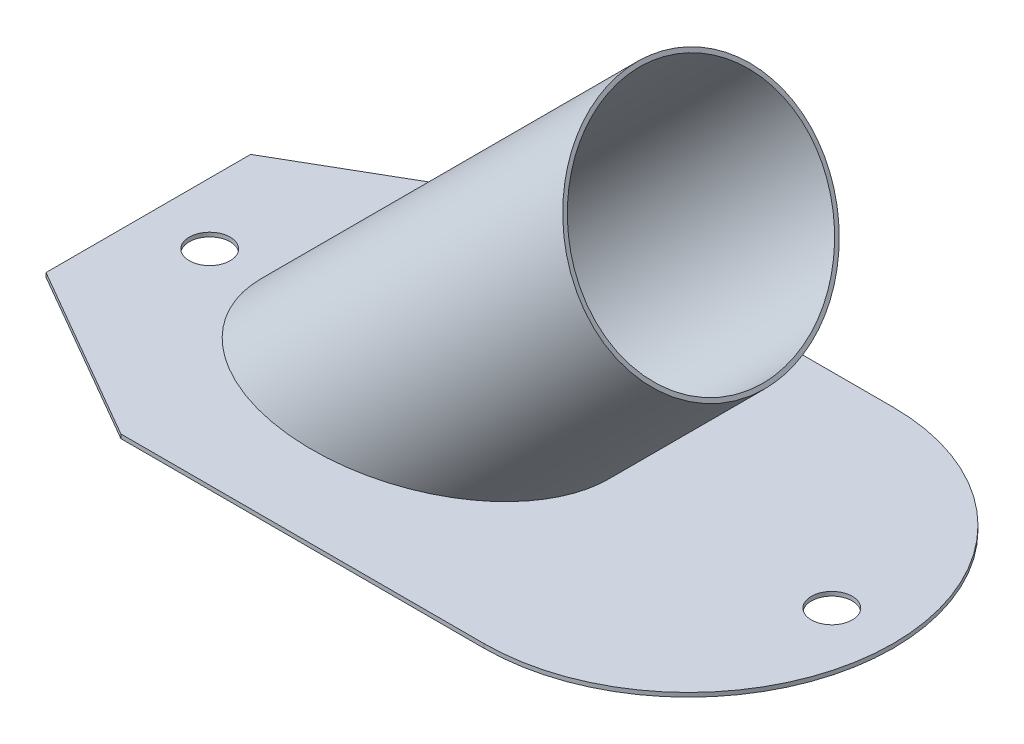
ISO-10303-21;
HEADER;
FILE_DESCRIPTION(('STEP AP214'),'2;1');
FILE_NAME('part.step','',(''),(''),'','','');
FILE_SCHEMA(('AUTOMOTIVE_DESIGN { 1 0 10303 214 1 1 1 1 }'));
ENDSEC;
DATA;
#1=APPLICATION_CONTEXT('core data for automotive mechanical design processes');
#2=APPLICATION_PROTOCOL_DEFINITION('international standard','automotive_design',2000,#1);
#3=PRODUCT_CONTEXT('',#1,'mechanical');
#4=PRODUCT('Part','Part','',(#3));
#5=PRODUCT_RELATED_PRODUCT_CATEGORY('part','',(#4));
#6=PRODUCT_DEFINITION_FORMATION('','',#4);
#7=PRODUCT_DEFINITION_CONTEXT('part definition',#1,'design');
#8=PRODUCT_DEFINITION('design','',#6,#7);
#9=PRODUCT_DEFINITION_SHAPE('','',#8);
#10=(LENGTH_UNIT() NAMED_UNIT(*) SI_UNIT(.MILLI.,.METRE.));
#11=(NAMED_UNIT(*) PLANE_ANGLE_UNIT() SI_UNIT($,.RADIAN.));
#12=(NAMED_UNIT(*) SI_UNIT($,.STERADIAN.) SOLID_ANGLE_UNIT());
#13=UNCERTAINTY_MEASURE_WITH_UNIT(LENGTH_MEASURE(1.E-05),#10,'distance_accuracy_value','');
#14=(GEOMETRIC_REPRESENTATION_CONTEXT(3) GLOBAL_UNCERTAINTY_ASSIGNED_CONTEXT((#13)) GLOBAL_UNIT_ASSIGNED_CONTEXT((#10,
#11,#12)) REPRESENTATION_CONTEXT('',''));
#15=CARTESIAN_POINT('',(0.,0.,0.));
#16=DIRECTION('',(0.,0.,1.));
#17=DIRECTION('',(1.,0.,0.));
#18=AXIS2_PLACEMENT_3D('',#15,#16,#17);
#19=CARTESIAN_POINT('',(21.2132034355964,-21.2132034355964,0.));
#20=DIRECTION('',(-0.707106781186548,-0.707106781186548,0.));
#21=DIRECTION('',(0.707106781186548,-0.707106781186548,0.));
#22=AXIS2_PLACEMENT_3D('',#19,#20,#21);
#23=CYLINDRICAL_SURFACE('',#22,30.);
#24=CARTESIAN_POINT('',(42.4264068711929,0.,0.));
#25=DIRECTION('',(0.,1.,0.));
#26=DIRECTION('',(-1.,0.,0.));
#27=AXIS2_PLACEMENT_3D('',#24,#25,#26);
#28=ELLIPSE('',#27,42.4264068711929,30.);
#29=CARTESIAN_POINT('',(0.,0.,0.));
#30=VERTEX_POINT('',#29);
#31=EDGE_CURVE('E37',#30,#30,#28,.T.);
#32=ORIENTED_EDGE('',*,*,#31,.T.);
#33=EDGE_LOOP('',(#32));
#34=FACE_BOUND('',#33,.T.);
#35=CARTESIAN_POINT('',(107.453024260403,65.0266173892097,0.));
#36=DIRECTION('',(-0.866025403784437,-0.500000000000003,0.));
#37=DIRECTION('',(0.500000000000003,-0.866025403784437,0.));
#38=AXIS2_PLACEMENT_3D('',#35,#36,#37);
#39=ELLIPSE('',#38,31.0582854123025,30.);
#40=CARTESIAN_POINT('',(122.982166966554,38.1293532241681,0.));
#41=VERTEX_POINT('',#40);
#42=EDGE_CURVE('E11',#41,#41,#39,.T.);
#43=ORIENTED_EDGE('',*,*,#42,.T.);
#44=EDGE_LOOP('',(#43));
#45=FACE_BOUND('',#44,.T.);
#46=ADVANCED_FACE('F30',(#34,#45),#23,.T.);
#47=CARTESIAN_POINT('',(91.9238815542512,91.9238815542512,-30.));
#48=DIRECTION('',(-0.866025403784437,-0.500000000000003,0.));
#49=DIRECTION('',(0.500000000000003,-0.866025403784437,0.));
#50=AXIS2_PLACEMENT_3D('',#47,#48,#49);
#51=PLANE('',#50);
#52=CARTESIAN_POINT('',(107.453024260403,65.0266173892097,0.));
#53=DIRECTION('',(-0.866025403784437,-0.500000000000003,0.));
#54=DIRECTION('',(0.500000000000003,-0.866025403784437,0.));
#55=AXIS2_PLACEMENT_3D('',#52,#53,#54);
#56=ELLIPSE('',#55,30.0230092318924,29.);
#57=CARTESIAN_POINT('',(122.464528876349,39.0259286963362,0.));
#58=VERTEX_POINT('',#57);
#59=EDGE_CURVE('E278',#58,#58,#56,.T.);
#60=ORIENTED_EDGE('',*,*,#59,.T.);
#61=EDGE_LOOP('',(#60));
#62=FACE_BOUND('',#61,.T.);
#63=ORIENTED_EDGE('',*,*,#42,.F.);
#64=EDGE_LOOP('',(#63));
#65=FACE_BOUND('',#64,.T.);
#66=ADVANCED_FACE('F144',(#62,#65),#51,.F.);
#67=CARTESIAN_POINT('',(104.426406871193,0.,0.));
#68=DIRECTION('',(0.,1.,0.));
#69=DIRECTION('',(0.,0.,1.));
#70=AXIS2_PLACEMENT_3D('',#67,#68,#69);
#71=PLANE('',#70);
#72=CARTESIAN_POINT('',(104.426406871193,0.,0.));
#73=DIRECTION('',(0.,1.,0.));
#74=DIRECTION('',(0.,0.,1.));
#75=AXIS2_PLACEMENT_3D('',#72,#73,#74);
#76=CIRCLE('',#75,50.);
#77=CARTESIAN_POINT('',(104.426406871193,0.,50.));
#78=VERTEX_POINT('',#77);
#79=CARTESIAN_POINT('',(104.426406871193,0.,-50.));
#80=VERTEX_POINT('',#79);
#81=EDGE_CURVE('E85',#78,#80,#76,.T.);
#82=ORIENTED_EDGE('',*,*,#81,.T.);
#83=DIRECTION('',(-1.,0.,0.));
#84=VECTOR('',#83,1.);
#85=CARTESIAN_POINT('',(104.426406871193,0.,-50.));
#86=LINE('',#85,#84);
#87=CARTESIAN_POINT('',(15.7276770604148,0.,-50.));
#88=VERTEX_POINT('',#87);
#89=EDGE_CURVE('E95',#80,#88,#86,.T.);
#90=ORIENTED_EDGE('',*,*,#89,.T.);
#91=DIRECTION('',(-0.866025403784439,0.,0.5));
#92=VECTOR('',#91,1.);
#93=CARTESIAN_POINT('',(15.7276770604148,0.,-50.));
#94=LINE('',#93,#92);
#95=CARTESIAN_POINT('',(-27.5735931288072,0.,-25.));
#96=VERTEX_POINT('',#95);
#97=EDGE_CURVE('E100',#88,#96,#94,.T.);
#98=ORIENTED_EDGE('',*,*,#97,.T.);
#99=DIRECTION('',(0.,0.,1.));
#100=VECTOR('',#99,1.);
#101=CARTESIAN_POINT('',(-27.5735931288072,0.,-25.));
#102=LINE('',#101,#100);
#103=CARTESIAN_POINT('',(-27.5735931288072,0.,25.));
#104=VERTEX_POINT('',#103);
#105=EDGE_CURVE('E114',#96,#104,#102,.T.);
#106=ORIENTED_EDGE('',*,*,#105,.T.);
#107=DIRECTION('',(0.866025403784438,0.,0.5));
#108=VECTOR('',#107,1.);
#109=CARTESIAN_POINT('',(-27.5735931288072,0.,25.));
#110=LINE('',#109,#108);
#111=CARTESIAN_POINT('',(15.7276770604148,0.,50.));
#112=VERTEX_POINT('',#111);
#113=EDGE_CURVE('E117',#104,#112,#110,.T.);
#114=ORIENTED_EDGE('',*,*,#113,.T.);
#115=DIRECTION('',(1.,0.,0.));
#116=VECTOR('',#115,1.);
#117=CARTESIAN_POINT('',(104.426406871193,0.,50.));
#118=LINE('',#117,#116);
#119=EDGE_CURVE('E105',#112,#78,#118,.T.);
#120=ORIENTED_EDGE('',*,*,#119,.T.);
#121=EDGE_LOOP('',(#82,#90,#98,#106,#114,#120));
#122=FACE_BOUND('',#121,.T.);
#123=CARTESIAN_POINT('',(-12.5735931288072,0.,0.));
#124=DIRECTION('',(0.,1.,0.));
#125=DIRECTION('',(0.,0.,1.));
#126=AXIS2_PLACEMENT_3D('',#123,#124,#125);
#127=CIRCLE('',#126,5.);
#128=CARTESIAN_POINT('',(-12.5735931288072,0.,5.00000000000002));
#129=VERTEX_POINT('',#128);
#130=EDGE_CURVE('E109',#129,#129,#127,.T.);
#131=ORIENTED_EDGE('',*,*,#130,.F.);
#132=EDGE_LOOP('',(#131));
#133=FACE_BOUND('',#132,.T.);
#134=CARTESIAN_POINT('',(139.426406871193,0.,0.));
#135=DIRECTION('',(0.,1.,0.));
#136=DIRECTION('',(0.,0.,1.));
#137=AXIS2_PLACEMENT_3D('',#134,#135,#136);
#138=CIRCLE('',#137,4.99999999999999);
#139=CARTESIAN_POINT('',(139.426406871193,0.,4.99999999999999));
#140=VERTEX_POINT('',#139);
#141=EDGE_CURVE('E273',#140,#140,#138,.T.);
#142=ORIENTED_EDGE('',*,*,#141,.F.);
#143=EDGE_LOOP('',(#142));
#144=FACE_BOUND('',#143,.T.);
#145=ORIENTED_EDGE('',*,*,#31,.F.);
#146=EDGE_LOOP('',(#145));
#147=FACE_BOUND('',#146,.T.);
#148=ADVANCED_FACE('F102',(#122,#133,#144,#147),#71,.T.);
#149=CARTESIAN_POINT('',(104.426406871193,-1.,0.));
#150=DIRECTION('',(0.,1.,0.));
#151=DIRECTION('',(0.,0.,1.));
#152=AXIS2_PLACEMENT_3D('',#149,#150,#151);
#153=CYLINDRICAL_SURFACE('',#152,50.);
#154=ORIENTED_EDGE('',*,*,#81,.F.);
#155=DIRECTION('',(0.,1.,0.));
#156=VECTOR('',#155,1.);
#157=CARTESIAN_POINT('',(104.426406871193,-1.,50.));
#158=LINE('',#157,#156);
#159=CARTESIAN_POINT('',(104.426406871193,-1.,50.));
#160=VERTEX_POINT('',#159);
#161=EDGE_CURVE('E44',#160,#78,#158,.T.);
#162=ORIENTED_EDGE('',*,*,#161,.F.);
#163=CARTESIAN_POINT('',(104.426406871193,-1.,0.));
#164=DIRECTION('',(0.,1.,0.));
#165=DIRECTION('',(0.,0.,1.));
#166=AXIS2_PLACEMENT_3D('',#163,#164,#165);
#167=CIRCLE('',#166,50.);
#168=CARTESIAN_POINT('',(104.426406871193,-1.,-50.));
#169=VERTEX_POINT('',#168);
#170=EDGE_CURVE('E87',#160,#169,#167,.T.);
#171=ORIENTED_EDGE('',*,*,#170,.T.);
#172=DIRECTION('',(0.,1.,0.));
#173=VECTOR('',#172,1.);
#174=CARTESIAN_POINT('',(104.426406871193,-1.,-50.));
#175=LINE('',#174,#173);
#176=EDGE_CURVE('E81',#169,#80,#175,.T.);
#177=ORIENTED_EDGE('',*,*,#176,.T.);
#178=EDGE_LOOP('',(#154,#162,#171,#177));
#179=FACE_BOUND('',#178,.T.);
#180=ADVANCED_FACE('F83',(#179),#153,.T.);
#181=CARTESIAN_POINT('',(104.426406871193,-1.,50.));
#182=DIRECTION('',(0.,0.,1.));
#183=DIRECTION('',(1.,0.,0.));
#184=AXIS2_PLACEMENT_3D('',#181,#182,#183);
#185=PLANE('',#184);
#186=ORIENTED_EDGE('',*,*,#119,.F.);
#187=DIRECTION('',(0.,1.,0.));
#188=VECTOR('',#187,1.);
#189=CARTESIAN_POINT('',(15.7276770604148,-1.,50.));
#190=LINE('',#189,#188);
#191=CARTESIAN_POINT('',(15.7276770604148,-1.,50.));
#192=VERTEX_POINT('',#191);
#193=EDGE_CURVE('E52',#192,#112,#190,.T.);
#194=ORIENTED_EDGE('',*,*,#193,.F.);
#195=DIRECTION('',(1.,0.,0.));
#196=VECTOR('',#195,1.);
#197=CARTESIAN_POINT('',(104.426406871193,-1.,50.));
#198=LINE('',#197,#196);
#199=EDGE_CURVE('E92',#192,#160,#198,.T.);
#200=ORIENTED_EDGE('',*,*,#199,.T.);
#201=ORIENTED_EDGE('',*,*,#161,.T.);
#202=EDGE_LOOP('',(#186,#194,#200,#201));
#203=FACE_BOUND('',#202,.T.);
#204=ADVANCED_FACE('F150',(#203),#185,.T.);
#205=CARTESIAN_POINT('',(-27.5735931288072,-1.,25.));
#206=DIRECTION('',(-0.5,0.,0.866025403784438));
#207=DIRECTION('',(0.866025403784438,0.,0.5));
#208=AXIS2_PLACEMENT_3D('',#205,#206,#207);
#209=PLANE('',#208);
#210=ORIENTED_EDGE('',*,*,#113,.F.);
#211=DIRECTION('',(0.,1.,0.));
#212=VECTOR('',#211,1.);
#213=CARTESIAN_POINT('',(-27.5735931288072,-1.,25.));
#214=LINE('',#213,#212);
#215=CARTESIAN_POINT('',(-27.5735931288072,-1.,25.));
#216=VERTEX_POINT('',#215);
#217=EDGE_CURVE('E134',#216,#104,#214,.T.);
#218=ORIENTED_EDGE('',*,*,#217,.F.);
#219=DIRECTION('',(0.866025403784438,0.,0.5));
#220=VECTOR('',#219,1.);
#221=CARTESIAN_POINT('',(-27.5735931288072,-1.,25.));
#222=LINE('',#221,#220);
#223=EDGE_CURVE('E129',#216,#192,#222,.T.);
#224=ORIENTED_EDGE('',*,*,#223,.T.);
#225=ORIENTED_EDGE('',*,*,#193,.T.);
#226=EDGE_LOOP('',(#210,#218,#224,#225));
#227=FACE_BOUND('',#226,.T.);
#228=ADVANCED_FACE('F227',(#227),#209,.T.);
#229=CARTESIAN_POINT('',(-27.5735931288072,-1.,-25.));
#230=DIRECTION('',(-1.,0.,0.));
#231=DIRECTION('',(0.,0.,1.));
#232=AXIS2_PLACEMENT_3D('',#229,#230,#231);
#233=PLANE('',#232);
#234=ORIENTED_EDGE('',*,*,#105,.F.);
#235=DIRECTION('',(0.,1.,0.));
#236=VECTOR('',#235,1.);
#237=CARTESIAN_POINT('',(-27.5735931288072,-1.,-25.));
#238=LINE('',#237,#236);
#239=CARTESIAN_POINT('',(-27.5735931288072,-1.,-25.));
#240=VERTEX_POINT('',#239);
#241=EDGE_CURVE('E136',#240,#96,#238,.T.);
#242=ORIENTED_EDGE('',*,*,#241,.F.);
#243=DIRECTION('',(0.,0.,1.));
#244=VECTOR('',#243,1.);
#245=CARTESIAN_POINT('',(-27.5735931288072,-1.,-25.));
#246=LINE('',#245,#244);
#247=EDGE_CURVE('E126',#240,#216,#246,.T.);
#248=ORIENTED_EDGE('',*,*,#247,.T.);
#249=ORIENTED_EDGE('',*,*,#217,.T.);
#250=EDGE_LOOP('',(#234,#242,#248,#249));
#251=FACE_BOUND('',#250,.T.);
#252=ADVANCED_FACE('F217',(#251),#233,.T.);
#253=CARTESIAN_POINT('',(15.7276770604148,-1.,-50.));
#254=DIRECTION('',(-0.5,0.,-0.866025403784439));
#255=DIRECTION('',(-0.866025403784439,0.,0.5));
#256=AXIS2_PLACEMENT_3D('',#253,#254,#255);
#257=PLANE('',#256);
#258=ORIENTED_EDGE('',*,*,#97,.F.);
#259=DIRECTION('',(0.,1.,0.));
#260=VECTOR('',#259,1.);
#261=CARTESIAN_POINT('',(15.7276770604148,-1.,-50.));
#262=LINE('',#261,#260);
#263=CARTESIAN_POINT('',(15.7276770604148,-1.,-50.));
#264=VERTEX_POINT('',#263);
#265=EDGE_CURVE('E91',#264,#88,#262,.T.);
#266=ORIENTED_EDGE('',*,*,#265,.F.);
#267=DIRECTION('',(-0.866025403784439,0.,0.5));
#268=VECTOR('',#267,1.);
#269=CARTESIAN_POINT('',(15.7276770604148,-1.,-50.));
#270=LINE('',#269,#268);
#271=EDGE_CURVE('E123',#264,#240,#270,.T.);
#272=ORIENTED_EDGE('',*,*,#271,.T.);
#273=ORIENTED_EDGE('',*,*,#241,.T.);
#274=EDGE_LOOP('',(#258,#266,#272,#273));
#275=FACE_BOUND('',#274,.T.);
#276=ADVANCED_FACE('F208',(#275),#257,.T.);
#277=CARTESIAN_POINT('',(104.426406871193,-1.,-50.));
#278=DIRECTION('',(0.,0.,-1.));
#279=DIRECTION('',(-1.,0.,0.));
#280=AXIS2_PLACEMENT_3D('',#277,#278,#279);
#281=PLANE('',#280);
#282=ORIENTED_EDGE('',*,*,#89,.F.);
#283=ORIENTED_EDGE('',*,*,#176,.F.);
#284=DIRECTION('',(-1.,0.,0.));
#285=VECTOR('',#284,1.);
#286=CARTESIAN_POINT('',(104.426406871193,-1.,-50.));
#287=LINE('',#286,#285);
#288=EDGE_CURVE('E121',#169,#264,#287,.T.);
#289=ORIENTED_EDGE('',*,*,#288,.T.);
#290=ORIENTED_EDGE('',*,*,#265,.T.);
#291=EDGE_LOOP('',(#282,#283,#289,#290));
#292=FACE_BOUND('',#291,.T.);
#293=ADVANCED_FACE('F96',(#292),#281,.T.);
#294=CARTESIAN_POINT('',(104.426406871193,-1.,0.));
#295=DIRECTION('',(0.,1.,0.));
#296=DIRECTION('',(0.,0.,1.));
#297=AXIS2_PLACEMENT_3D('',#294,#295,#296);
#298=PLANE('',#297);
#299=CARTESIAN_POINT('',(41.4264068711929,-1.,0.));
#300=DIRECTION('',(0.,1.,0.));
#301=DIRECTION('',(-1.,0.,0.));
#302=AXIS2_PLACEMENT_3D('',#299,#300,#301);
#303=ELLIPSE('',#302,41.0121933088198,29.);
#304=CARTESIAN_POINT('',(0.414213562373089,-1.,0.));
#305=VERTEX_POINT('',#304);
#306=EDGE_CURVE('E281',#305,#305,#303,.T.);
#307=ORIENTED_EDGE('',*,*,#306,.T.);
#308=EDGE_LOOP('',(#307));
#309=FACE_BOUND('',#308,.T.);
#310=CARTESIAN_POINT('',(139.426406871193,-1.,0.));
#311=DIRECTION('',(0.,1.,0.));
#312=DIRECTION('',(0.,0.,1.));
#313=AXIS2_PLACEMENT_3D('',#310,#311,#312);
#314=CIRCLE('',#313,4.99999999999999);
#315=CARTESIAN_POINT('',(139.426406871193,-1.,4.99999999999999));
#316=VERTEX_POINT('',#315);
#317=EDGE_CURVE('E271',#316,#316,#314,.T.);
#318=ORIENTED_EDGE('',*,*,#317,.T.);
#319=EDGE_LOOP('',(#318));
#320=FACE_BOUND('',#319,.T.);
#321=CARTESIAN_POINT('',(-12.5735931288072,-1.,0.));
#322=DIRECTION('',(0.,1.,0.));
#323=DIRECTION('',(0.,0.,1.));
#324=AXIS2_PLACEMENT_3D('',#321,#322,#323);
#325=CIRCLE('',#324,5.);
#326=CARTESIAN_POINT('',(-12.5735931288072,-1.,5.00000000000002));
#327=VERTEX_POINT('',#326);
#328=EDGE_CURVE('E106',#327,#327,#325,.T.);
#329=ORIENTED_EDGE('',*,*,#328,.T.);
#330=EDGE_LOOP('',(#329));
#331=FACE_BOUND('',#330,.T.);
#332=ORIENTED_EDGE('',*,*,#170,.F.);
#333=ORIENTED_EDGE('',*,*,#199,.F.);
#334=ORIENTED_EDGE('',*,*,#223,.F.);
#335=ORIENTED_EDGE('',*,*,#247,.F.);
#336=ORIENTED_EDGE('',*,*,#271,.F.);
#337=ORIENTED_EDGE('',*,*,#288,.F.);
#338=EDGE_LOOP('',(#332,#333,#334,#335,#336,#337));
#339=FACE_BOUND('',#338,.T.);
#340=ADVANCED_FACE('F174',(#309,#320,#331,#339),#298,.F.);
#341=CARTESIAN_POINT('',(-12.5735931288072,-1.,0.));
#342=DIRECTION('',(0.,1.,0.));
#343=DIRECTION('',(0.,0.,1.));
#344=AXIS2_PLACEMENT_3D('',#341,#342,#343);
#345=CYLINDRICAL_SURFACE('',#344,5.);
#346=ORIENTED_EDGE('',*,*,#328,.F.);
#347=EDGE_LOOP('',(#346));
#348=FACE_BOUND('',#347,.T.);
#349=ORIENTED_EDGE('',*,*,#130,.T.);
#350=EDGE_LOOP('',(#349));
#351=FACE_BOUND('',#350,.T.);
#352=ADVANCED_FACE('F179',(#348,#351),#345,.F.);
#353=CARTESIAN_POINT('',(139.426406871193,-1.,0.));
#354=DIRECTION('',(0.,1.,0.));
#355=DIRECTION('',(0.,0.,1.));
#356=AXIS2_PLACEMENT_3D('',#353,#354,#355);
#357=CYLINDRICAL_SURFACE('',#356,4.99999999999999);
#358=ORIENTED_EDGE('',*,*,#317,.F.);
#359=EDGE_LOOP('',(#358));
#360=FACE_BOUND('',#359,.T.);
#361=ORIENTED_EDGE('',*,*,#141,.T.);
#362=EDGE_LOOP('',(#361));
#363=FACE_BOUND('',#362,.T.);
#364=ADVANCED_FACE('F169',(#360,#363),#357,.F.);
#365=CARTESIAN_POINT('',(21.2132034355964,-21.2132034355964,0.));
#366=DIRECTION('',(-0.707106781186548,-0.707106781186548,0.));
#367=DIRECTION('',(0.707106781186548,-0.707106781186548,0.));
#368=AXIS2_PLACEMENT_3D('',#365,#366,#367);
#369=CYLINDRICAL_SURFACE('',#368,29.);
#370=ORIENTED_EDGE('',*,*,#306,.F.);
#371=EDGE_LOOP('',(#370));
#372=FACE_BOUND('',#371,.T.);
#373=ORIENTED_EDGE('',*,*,#59,.F.);
#374=EDGE_LOOP('',(#373));
#375=FACE_BOUND('',#374,.T.);
#376=ADVANCED_FACE('F188',(#372,#375),#369,.F.);
#377=CLOSED_SHELL('',(#46,#66,#148,#180,#204,#228,#252,#276,#293,#340,#352,#364,#376));
#378=MANIFOLD_SOLID_BREP('B2',#377);
#379=ADVANCED_BREP_SHAPE_REPRESENTATION('',(#18,#378),#14);
#380=SHAPE_DEFINITION_REPRESENTATION(#9,#379);
ENDSEC;
END-ISO-10303-21;
